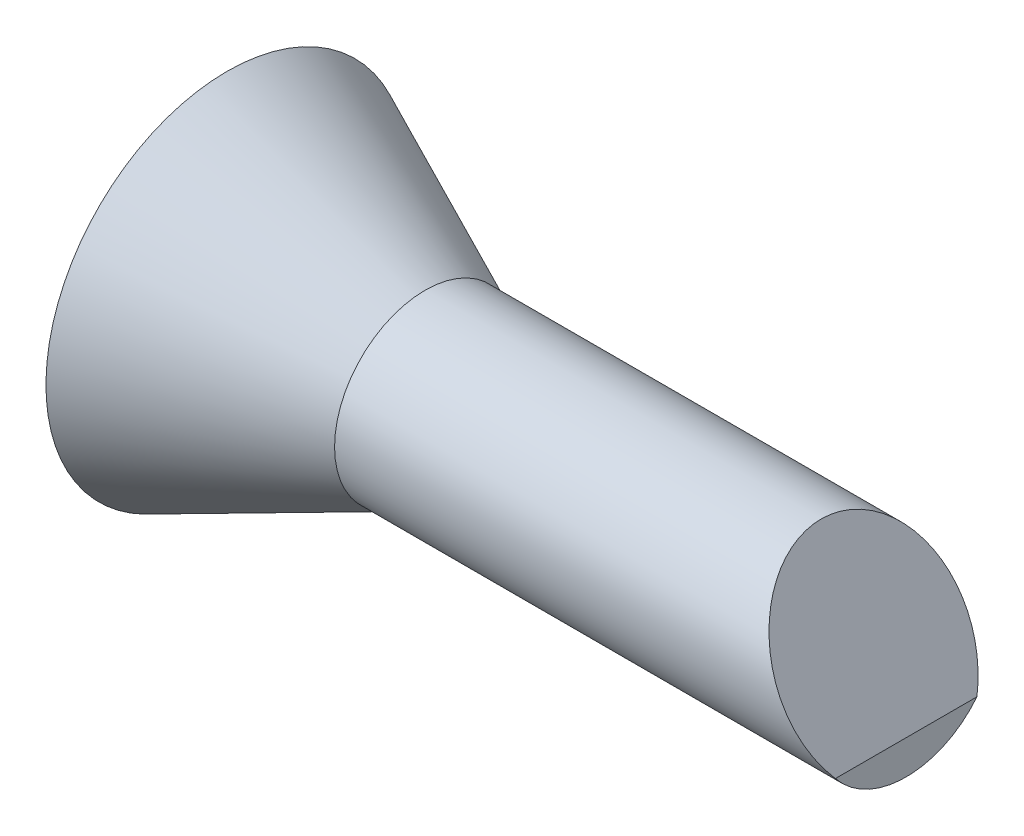
ISO-10303-21;
HEADER;
FILE_DESCRIPTION(('STEP AP214'),'2;1');
FILE_NAME('part.step','',(''),(''),'','','');
FILE_SCHEMA(('AUTOMOTIVE_DESIGN { 1 0 10303 214 1 1 1 1 }'));
ENDSEC;
DATA;
#1=APPLICATION_CONTEXT('core data for automotive mechanical design processes');
#2=APPLICATION_PROTOCOL_DEFINITION('international standard','automotive_design',2000,#1);
#3=PRODUCT_CONTEXT('',#1,'mechanical');
#4=PRODUCT('Part','Part','',(#3));
#5=PRODUCT_RELATED_PRODUCT_CATEGORY('part','',(#4));
#6=PRODUCT_DEFINITION_FORMATION('','',#4);
#7=PRODUCT_DEFINITION_CONTEXT('part definition',#1,'design');
#8=PRODUCT_DEFINITION('design','',#6,#7);
#9=PRODUCT_DEFINITION_SHAPE('','',#8);
#10=(LENGTH_UNIT() NAMED_UNIT(*) SI_UNIT(.MILLI.,.METRE.));
#11=(NAMED_UNIT(*) PLANE_ANGLE_UNIT() SI_UNIT($,.RADIAN.));
#12=(NAMED_UNIT(*) SI_UNIT($,.STERADIAN.) SOLID_ANGLE_UNIT());
#13=UNCERTAINTY_MEASURE_WITH_UNIT(LENGTH_MEASURE(1.E-05),#10,'distance_accuracy_value','');
#14=(GEOMETRIC_REPRESENTATION_CONTEXT(3) GLOBAL_UNCERTAINTY_ASSIGNED_CONTEXT((#13)) GLOBAL_UNIT_ASSIGNED_CONTEXT((#10,
#11,#12)) REPRESENTATION_CONTEXT('',''));
#15=CARTESIAN_POINT('',(0.,0.,0.));
#16=DIRECTION('',(0.,0.,1.));
#17=DIRECTION('',(1.,0.,0.));
#18=AXIS2_PLACEMENT_3D('',#15,#16,#17);
#19=CARTESIAN_POINT('',(0.,32.,0.));
#20=DIRECTION('',(1.,0.,0.));
#21=DIRECTION('',(0.,1.,0.));
#22=AXIS2_PLACEMENT_3D('',#19,#20,#21);
#23=PLANE('',#22);
#24=CARTESIAN_POINT('',(0.,32.,0.));
#25=DIRECTION('',(1.,0.,0.));
#26=DIRECTION('',(0.,1.,0.));
#27=AXIS2_PLACEMENT_3D('',#24,#25,#26);
#28=CIRCLE('',#27,32.);
#29=CARTESIAN_POINT('',(0.,64.,0.));
#30=VERTEX_POINT('',#29);
#31=EDGE_CURVE('E47',#30,#30,#28,.T.);
#32=ORIENTED_EDGE('',*,*,#31,.F.);
#33=EDGE_LOOP('',(#32));
#34=FACE_BOUND('',#33,.T.);
#35=ADVANCED_FACE('F39',(#34),#23,.F.);
#36=CARTESIAN_POINT('',(0.,32.,0.));
#37=DIRECTION('',(-1.,0.,0.));
#38=DIRECTION('',(0.,-1.,0.));
#39=AXIS2_PLACEMENT_3D('',#36,#37,#38);
#40=CONICAL_SURFACE('',#39,32.,0.428778027446017);
#41=CARTESIAN_POINT('',(35.,32.,0.));
#42=DIRECTION('',(1.,0.,0.));
#43=DIRECTION('',(0.,1.,0.));
#44=AXIS2_PLACEMENT_3D('',#41,#42,#43);
#45=CIRCLE('',#44,16.);
#46=CARTESIAN_POINT('',(35.,48.,0.));
#47=VERTEX_POINT('',#46);
#48=EDGE_CURVE('E66',#47,#47,#45,.T.);
#49=ORIENTED_EDGE('',*,*,#48,.F.);
#50=EDGE_LOOP('',(#49));
#51=FACE_BOUND('',#50,.T.);
#52=ORIENTED_EDGE('',*,*,#31,.T.);
#53=EDGE_LOOP('',(#52));
#54=FACE_BOUND('',#53,.T.);
#55=ADVANCED_FACE('F75',(#51,#54),#40,.T.);
#56=CARTESIAN_POINT('',(120.,32.,0.));
#57=DIRECTION('',(1.,0.,0.));
#58=DIRECTION('',(0.,1.,0.));
#59=AXIS2_PLACEMENT_3D('',#56,#57,#58);
#60=CYLINDRICAL_SURFACE('',#59,16.);
#61=CARTESIAN_POINT('',(120.,32.,0.));
#62=DIRECTION('',(1.,0.,0.));
#63=DIRECTION('',(0.,1.,0.));
#64=AXIS2_PLACEMENT_3D('',#61,#62,#63);
#65=CIRCLE('',#64,16.);
#66=CARTESIAN_POINT('',(120.,22.0192378864667,12.5053743499768));
#67=VERTEX_POINT('',#66);
#68=CARTESIAN_POINT('',(120.,22.0192378864667,-12.5053743499768));
#69=VERTEX_POINT('',#68);
#70=EDGE_CURVE('E59',#67,#69,#65,.T.);
#71=ORIENTED_EDGE('',*,*,#70,.F.);
#72=CARTESIAN_POINT('',(114.237604307034,32.,0.));
#73=DIRECTION('',(-0.86602540378444,-0.499999999999998,0.));
#74=DIRECTION('',(0.499999999999998,-0.86602540378444,0.));
#75=AXIS2_PLACEMENT_3D('',#72,#73,#74);
#76=ELLIPSE('',#75,18.475208614068,16.);
#77=EDGE_CURVE('E53',#67,#69,#76,.T.);
#78=ORIENTED_EDGE('',*,*,#77,.T.);
#79=EDGE_LOOP('',(#71,#78));
#80=FACE_BOUND('',#79,.T.);
#81=ORIENTED_EDGE('',*,*,#48,.T.);
#82=EDGE_LOOP('',(#81));
#83=FACE_BOUND('',#82,.T.);
#84=ADVANCED_FACE('F56',(#80,#83),#60,.T.);
#85=CARTESIAN_POINT('',(120.,16.,0.));
#86=DIRECTION('',(-1.,0.,0.));
#87=DIRECTION('',(0.,-1.,0.));
#88=AXIS2_PLACEMENT_3D('',#85,#86,#87);
#89=PLANE('',#88);
#90=ORIENTED_EDGE('',*,*,#70,.T.);
#91=DIRECTION('',(0.,0.,1.));
#92=VECTOR('',#91,1.);
#93=CARTESIAN_POINT('',(120.,22.0192378864667,0.));
#94=LINE('',#93,#92);
#95=EDGE_CURVE('E11',#69,#67,#94,.T.);
#96=ORIENTED_EDGE('',*,*,#95,.T.);
#97=EDGE_LOOP('',(#90,#96));
#98=FACE_BOUND('',#97,.T.);
#99=ADVANCED_FACE('F64',(#98),#89,.F.);
#100=CARTESIAN_POINT('',(105.,48.,-30.));
#101=DIRECTION('',(-0.86602540378444,-0.499999999999998,0.));
#102=DIRECTION('',(0.499999999999998,-0.86602540378444,0.));
#103=AXIS2_PLACEMENT_3D('',#100,#101,#102);
#104=PLANE('',#103);
#105=ORIENTED_EDGE('',*,*,#95,.F.);
#106=ORIENTED_EDGE('',*,*,#77,.F.);
#107=EDGE_LOOP('',(#105,#106));
#108=FACE_BOUND('',#107,.T.);
#109=ADVANCED_FACE('F62',(#108),#104,.F.);
#110=CLOSED_SHELL('',(#35,#55,#84,#99,#109));
#111=MANIFOLD_SOLID_BREP('B2',#110);
#112=ADVANCED_BREP_SHAPE_REPRESENTATION('',(#18,#111),#14);
#113=SHAPE_DEFINITION_REPRESENTATION(#9,#112);
ENDSEC;
END-ISO-10303-21;
